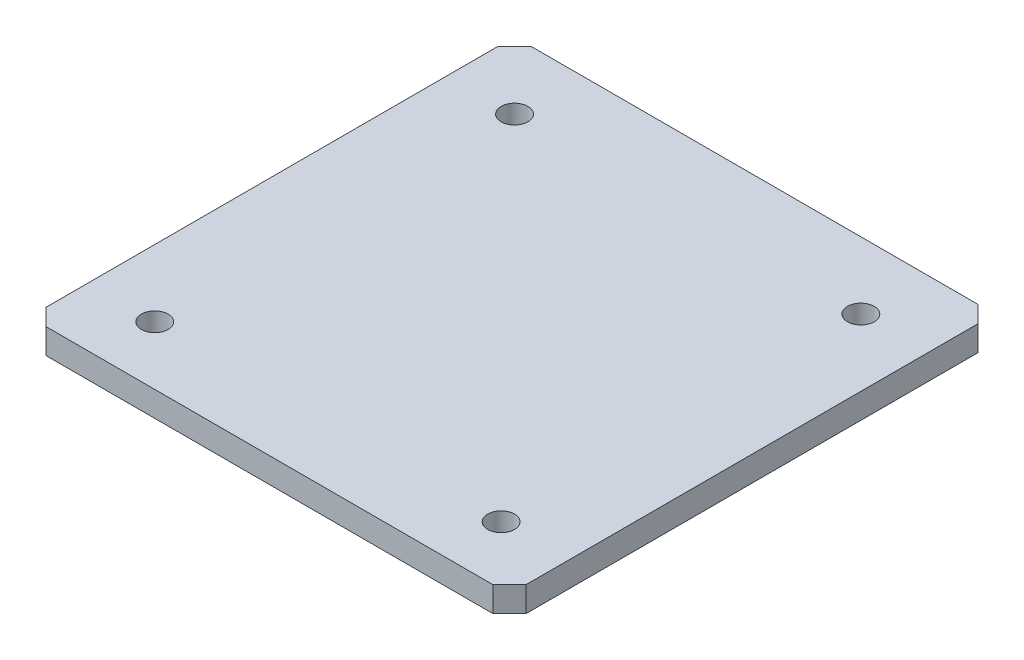
ISO-10303-21;
HEADER;
FILE_DESCRIPTION(('STEP AP214'),'2;1');
FILE_NAME('part.step','',(''),(''),'','','');
FILE_SCHEMA(('AUTOMOTIVE_DESIGN { 1 0 10303 214 1 1 1 1 }'));
ENDSEC;
DATA;
#1=APPLICATION_CONTEXT('core data for automotive mechanical design processes');
#2=APPLICATION_PROTOCOL_DEFINITION('international standard','automotive_design',2000,#1);
#3=PRODUCT_CONTEXT('',#1,'mechanical');
#4=PRODUCT('Part','Part','',(#3));
#5=PRODUCT_RELATED_PRODUCT_CATEGORY('part','',(#4));
#6=PRODUCT_DEFINITION_FORMATION('','',#4);
#7=PRODUCT_DEFINITION_CONTEXT('part definition',#1,'design');
#8=PRODUCT_DEFINITION('design','',#6,#7);
#9=PRODUCT_DEFINITION_SHAPE('','',#8);
#10=(LENGTH_UNIT() NAMED_UNIT(*) SI_UNIT(.MILLI.,.METRE.));
#11=(NAMED_UNIT(*) PLANE_ANGLE_UNIT() SI_UNIT($,.RADIAN.));
#12=(NAMED_UNIT(*) SI_UNIT($,.STERADIAN.) SOLID_ANGLE_UNIT());
#13=UNCERTAINTY_MEASURE_WITH_UNIT(LENGTH_MEASURE(1.E-05),#10,'distance_accuracy_value','');
#14=(GEOMETRIC_REPRESENTATION_CONTEXT(3) GLOBAL_UNCERTAINTY_ASSIGNED_CONTEXT((#13)) GLOBAL_UNIT_ASSIGNED_CONTEXT((#10,
#11,#12)) REPRESENTATION_CONTEXT('',''));
#15=CARTESIAN_POINT('',(0.,0.,0.));
#16=DIRECTION('',(0.,0.,1.));
#17=DIRECTION('',(1.,0.,0.));
#18=AXIS2_PLACEMENT_3D('',#15,#16,#17);
#19=CARTESIAN_POINT('',(0.,7.5,0.));
#20=DIRECTION('',(1.,0.,0.));
#21=DIRECTION('',(0.,0.,-1.));
#22=AXIS2_PLACEMENT_3D('',#19,#20,#21);
#23=PLANE('',#22);
#24=DIRECTION('',(0.,0.,1.));
#25=VECTOR('',#24,1.);
#26=CARTESIAN_POINT('',(0.,7.5,0.));
#27=LINE('',#26,#25);
#28=CARTESIAN_POINT('',(0.,7.5,-280.));
#29=VERTEX_POINT('',#28);
#30=CARTESIAN_POINT('',(0.,7.5,-10.0000000000001));
#31=VERTEX_POINT('',#30);
#32=EDGE_CURVE('E128',#29,#31,#27,.T.);
#33=ORIENTED_EDGE('',*,*,#32,.F.);
#34=DIRECTION('',(0.,-1.,0.));
#35=VECTOR('',#34,1.);
#36=CARTESIAN_POINT('',(0.,7.5,-280.));
#37=LINE('',#36,#35);
#38=CARTESIAN_POINT('',(0.,-7.5,-280.));
#39=VERTEX_POINT('',#38);
#40=EDGE_CURVE('E113',#29,#39,#37,.T.);
#41=ORIENTED_EDGE('',*,*,#40,.T.);
#42=DIRECTION('',(0.,0.,1.));
#43=VECTOR('',#42,1.);
#44=CARTESIAN_POINT('',(0.,-7.5,0.));
#45=LINE('',#44,#43);
#46=CARTESIAN_POINT('',(0.,-7.5,-10.0000000000001));
#47=VERTEX_POINT('',#46);
#48=EDGE_CURVE('E125',#39,#47,#45,.T.);
#49=ORIENTED_EDGE('',*,*,#48,.T.);
#50=DIRECTION('',(0.,1.,0.));
#51=VECTOR('',#50,1.);
#52=CARTESIAN_POINT('',(0.,7.5,-10.0000000000001));
#53=LINE('',#52,#51);
#54=EDGE_CURVE('E130',#47,#31,#53,.T.);
#55=ORIENTED_EDGE('',*,*,#54,.T.);
#56=EDGE_LOOP('',(#33,#41,#49,#55));
#57=FACE_BOUND('',#56,.T.);
#58=ADVANCED_FACE('F39',(#57),#23,.F.);
#59=CARTESIAN_POINT('',(0.,7.5,0.));
#60=DIRECTION('',(0.,0.,-1.));
#61=DIRECTION('',(-1.,0.,0.));
#62=AXIS2_PLACEMENT_3D('',#59,#60,#61);
#63=PLANE('',#62);
#64=DIRECTION('',(1.,0.,0.));
#65=VECTOR('',#64,1.);
#66=CARTESIAN_POINT('',(0.,7.5,0.));
#67=LINE('',#66,#65);
#68=CARTESIAN_POINT('',(10.,7.5,0.));
#69=VERTEX_POINT('',#68);
#70=CARTESIAN_POINT('',(277.,7.5,0.));
#71=VERTEX_POINT('',#70);
#72=EDGE_CURVE('E207',#69,#71,#67,.T.);
#73=ORIENTED_EDGE('',*,*,#72,.F.);
#74=DIRECTION('',(0.,-1.,0.));
#75=VECTOR('',#74,1.);
#76=CARTESIAN_POINT('',(10.,7.5,0.));
#77=LINE('',#76,#75);
#78=CARTESIAN_POINT('',(10.,-7.5,0.));
#79=VERTEX_POINT('',#78);
#80=EDGE_CURVE('E11',#69,#79,#77,.T.);
#81=ORIENTED_EDGE('',*,*,#80,.T.);
#82=DIRECTION('',(1.,0.,0.));
#83=VECTOR('',#82,1.);
#84=CARTESIAN_POINT('',(0.,-7.5,0.));
#85=LINE('',#84,#83);
#86=CARTESIAN_POINT('',(277.,-7.5,0.));
#87=VERTEX_POINT('',#86);
#88=EDGE_CURVE('E135',#79,#87,#85,.T.);
#89=ORIENTED_EDGE('',*,*,#88,.T.);
#90=DIRECTION('',(0.,1.,0.));
#91=VECTOR('',#90,1.);
#92=CARTESIAN_POINT('',(277.,7.5,0.));
#93=LINE('',#92,#91);
#94=EDGE_CURVE('E49',#87,#71,#93,.T.);
#95=ORIENTED_EDGE('',*,*,#94,.T.);
#96=EDGE_LOOP('',(#73,#81,#89,#95));
#97=FACE_BOUND('',#96,.T.);
#98=ADVANCED_FACE('F224',(#97),#63,.F.);
#99=CARTESIAN_POINT('',(287.,7.5,0.));
#100=DIRECTION('',(-1.,0.,0.));
#101=DIRECTION('',(0.,0.,1.));
#102=AXIS2_PLACEMENT_3D('',#99,#100,#101);
#103=PLANE('',#102);
#104=DIRECTION('',(0.,0.,-1.));
#105=VECTOR('',#104,1.);
#106=CARTESIAN_POINT('',(287.,-7.5,0.));
#107=LINE('',#106,#105);
#108=CARTESIAN_POINT('',(287.,-7.5,-10.));
#109=VERTEX_POINT('',#108);
#110=CARTESIAN_POINT('',(287.,-7.5,-280.));
#111=VERTEX_POINT('',#110);
#112=EDGE_CURVE('E138',#109,#111,#107,.T.);
#113=ORIENTED_EDGE('',*,*,#112,.T.);
#114=DIRECTION('',(0.,1.,0.));
#115=VECTOR('',#114,1.);
#116=CARTESIAN_POINT('',(287.,7.5,-280.));
#117=LINE('',#116,#115);
#118=CARTESIAN_POINT('',(287.,7.5,-280.));
#119=VERTEX_POINT('',#118);
#120=EDGE_CURVE('E57',#111,#119,#117,.T.);
#121=ORIENTED_EDGE('',*,*,#120,.T.);
#122=DIRECTION('',(0.,0.,-1.));
#123=VECTOR('',#122,1.);
#124=CARTESIAN_POINT('',(287.,7.5,0.));
#125=LINE('',#124,#123);
#126=CARTESIAN_POINT('',(287.,7.5,-10.));
#127=VERTEX_POINT('',#126);
#128=EDGE_CURVE('E208',#127,#119,#125,.T.);
#129=ORIENTED_EDGE('',*,*,#128,.F.);
#130=DIRECTION('',(0.,-1.,0.));
#131=VECTOR('',#130,1.);
#132=CARTESIAN_POINT('',(287.,7.5,-10.));
#133=LINE('',#132,#131);
#134=EDGE_CURVE('E163',#127,#109,#133,.T.);
#135=ORIENTED_EDGE('',*,*,#134,.T.);
#136=EDGE_LOOP('',(#113,#121,#129,#135));
#137=FACE_BOUND('',#136,.T.);
#138=ADVANCED_FACE('F218',(#137),#103,.F.);
#139=CARTESIAN_POINT('',(0.,7.5,-290.));
#140=DIRECTION('',(0.,0.,1.));
#141=DIRECTION('',(1.,0.,0.));
#142=AXIS2_PLACEMENT_3D('',#139,#140,#141);
#143=PLANE('',#142);
#144=DIRECTION('',(-1.,0.,0.));
#145=VECTOR('',#144,1.);
#146=CARTESIAN_POINT('',(0.,-7.5,-290.));
#147=LINE('',#146,#145);
#148=CARTESIAN_POINT('',(277.,-7.5,-290.));
#149=VERTEX_POINT('',#148);
#150=CARTESIAN_POINT('',(10.0000000000001,-7.5,-290.));
#151=VERTEX_POINT('',#150);
#152=EDGE_CURVE('E147',#149,#151,#147,.T.);
#153=ORIENTED_EDGE('',*,*,#152,.T.);
#154=DIRECTION('',(0.,1.,0.));
#155=VECTOR('',#154,1.);
#156=CARTESIAN_POINT('',(10.0000000000001,7.5,-290.));
#157=LINE('',#156,#155);
#158=CARTESIAN_POINT('',(10.0000000000001,7.5,-290.));
#159=VERTEX_POINT('',#158);
#160=EDGE_CURVE('E114',#151,#159,#157,.T.);
#161=ORIENTED_EDGE('',*,*,#160,.T.);
#162=DIRECTION('',(-1.,0.,0.));
#163=VECTOR('',#162,1.);
#164=CARTESIAN_POINT('',(0.,7.5,-290.));
#165=LINE('',#164,#163);
#166=CARTESIAN_POINT('',(277.,7.5,-290.));
#167=VERTEX_POINT('',#166);
#168=EDGE_CURVE('E143',#167,#159,#165,.T.);
#169=ORIENTED_EDGE('',*,*,#168,.F.);
#170=DIRECTION('',(0.,-1.,0.));
#171=VECTOR('',#170,1.);
#172=CARTESIAN_POINT('',(277.,7.5,-290.));
#173=LINE('',#172,#171);
#174=EDGE_CURVE('E119',#167,#149,#173,.T.);
#175=ORIENTED_EDGE('',*,*,#174,.T.);
#176=EDGE_LOOP('',(#153,#161,#169,#175));
#177=FACE_BOUND('',#176,.T.);
#178=ADVANCED_FACE('F214',(#177),#143,.F.);
#179=CARTESIAN_POINT('',(0.,7.5,0.));
#180=DIRECTION('',(0.,-1.,0.));
#181=DIRECTION('',(0.,0.,-1.));
#182=AXIS2_PLACEMENT_3D('',#179,#180,#181);
#183=PLANE('',#182);
#184=CARTESIAN_POINT('',(246.999999999996,7.5,-35.0000000000001));
#185=DIRECTION('',(0.,1.,0.));
#186=DIRECTION('',(0.,0.,1.));
#187=AXIS2_PLACEMENT_3D('',#184,#185,#186);
#188=CIRCLE('',#187,8.00000000000001);
#189=CARTESIAN_POINT('',(246.999999999996,7.5,-27.0000000000001));
#190=VERTEX_POINT('',#189);
#191=EDGE_CURVE('E204',#190,#190,#188,.T.);
#192=ORIENTED_EDGE('',*,*,#191,.F.);
#193=EDGE_LOOP('',(#192));
#194=FACE_BOUND('',#193,.T.);
#195=CARTESIAN_POINT('',(246.999999999996,7.5,-250.));
#196=DIRECTION('',(0.,1.,0.));
#197=DIRECTION('',(0.,0.,1.));
#198=AXIS2_PLACEMENT_3D('',#195,#196,#197);
#199=CIRCLE('',#198,8.00000000000001);
#200=CARTESIAN_POINT('',(246.999999999996,7.5,-242.));
#201=VERTEX_POINT('',#200);
#202=EDGE_CURVE('E200',#201,#201,#199,.T.);
#203=ORIENTED_EDGE('',*,*,#202,.F.);
#204=EDGE_LOOP('',(#203));
#205=FACE_BOUND('',#204,.T.);
#206=CARTESIAN_POINT('',(39.9999999999957,7.5,-250.));
#207=DIRECTION('',(0.,1.,0.));
#208=DIRECTION('',(0.,0.,1.));
#209=AXIS2_PLACEMENT_3D('',#206,#207,#208);
#210=CIRCLE('',#209,8.00000000000001);
#211=CARTESIAN_POINT('',(39.9999999999957,7.5,-242.));
#212=VERTEX_POINT('',#211);
#213=EDGE_CURVE('E197',#212,#212,#210,.T.);
#214=ORIENTED_EDGE('',*,*,#213,.F.);
#215=EDGE_LOOP('',(#214));
#216=FACE_BOUND('',#215,.T.);
#217=CARTESIAN_POINT('',(39.9999999999956,7.5,-35.0000000000001));
#218=DIRECTION('',(0.,1.,0.));
#219=DIRECTION('',(0.,0.,1.));
#220=AXIS2_PLACEMENT_3D('',#217,#218,#219);
#221=CIRCLE('',#220,8.00000000000001);
#222=CARTESIAN_POINT('',(39.9999999999956,7.5,-27.0000000000001));
#223=VERTEX_POINT('',#222);
#224=EDGE_CURVE('E172',#223,#223,#221,.T.);
#225=ORIENTED_EDGE('',*,*,#224,.F.);
#226=EDGE_LOOP('',(#225));
#227=FACE_BOUND('',#226,.T.);
#228=ORIENTED_EDGE('',*,*,#168,.T.);
#229=DIRECTION('',(0.707106781186549,0.,-0.707106781186546));
#230=VECTOR('',#229,1.);
#231=CARTESIAN_POINT('',(0.,7.5,-280.));
#232=LINE('',#231,#230);
#233=EDGE_CURVE('E161',#159,#29,#232,.F.);
#234=ORIENTED_EDGE('',*,*,#233,.T.);
#235=ORIENTED_EDGE('',*,*,#32,.T.);
#236=DIRECTION('',(-0.707106781186546,0.,-0.707106781186549));
#237=VECTOR('',#236,1.);
#238=CARTESIAN_POINT('',(10.,7.5,0.));
#239=LINE('',#238,#237);
#240=EDGE_CURVE('E157',#31,#69,#239,.F.);
#241=ORIENTED_EDGE('',*,*,#240,.T.);
#242=ORIENTED_EDGE('',*,*,#72,.T.);
#243=DIRECTION('',(-0.707106781186549,0.,0.707106781186546));
#244=VECTOR('',#243,1.);
#245=CARTESIAN_POINT('',(287.,7.5,-10.));
#246=LINE('',#245,#244);
#247=EDGE_CURVE('E64',#71,#127,#246,.F.);
#248=ORIENTED_EDGE('',*,*,#247,.T.);
#249=ORIENTED_EDGE('',*,*,#128,.T.);
#250=DIRECTION('',(0.707106781186546,0.,0.707106781186549));
#251=VECTOR('',#250,1.);
#252=CARTESIAN_POINT('',(277.,7.5,-290.));
#253=LINE('',#252,#251);
#254=EDGE_CURVE('E159',#119,#167,#253,.F.);
#255=ORIENTED_EDGE('',*,*,#254,.T.);
#256=EDGE_LOOP('',(#228,#234,#235,#241,#242,#248,#249,#255));
#257=FACE_BOUND('',#256,.T.);
#258=ADVANCED_FACE('F182',(#194,#205,#216,#227,#257),#183,.F.);
#259=CARTESIAN_POINT('',(0.,-7.5,0.));
#260=DIRECTION('',(0.,-1.,0.));
#261=DIRECTION('',(0.,0.,-1.));
#262=AXIS2_PLACEMENT_3D('',#259,#260,#261);
#263=PLANE('',#262);
#264=CARTESIAN_POINT('',(246.999999999996,-7.5,-35.0000000000001));
#265=DIRECTION('',(0.,-1.,0.));
#266=DIRECTION('',(0.,0.,-1.));
#267=AXIS2_PLACEMENT_3D('',#264,#265,#266);
#268=CIRCLE('',#267,8.00000000000001);
#269=CARTESIAN_POINT('',(246.999999999996,-7.5,-43.0000000000001));
#270=VERTEX_POINT('',#269);
#271=EDGE_CURVE('E44',#270,#270,#268,.T.);
#272=ORIENTED_EDGE('',*,*,#271,.F.);
#273=EDGE_LOOP('',(#272));
#274=FACE_BOUND('',#273,.T.);
#275=CARTESIAN_POINT('',(246.999999999996,-7.5,-250.));
#276=DIRECTION('',(0.,-1.,0.));
#277=DIRECTION('',(0.,0.,-1.));
#278=AXIS2_PLACEMENT_3D('',#275,#276,#277);
#279=CIRCLE('',#278,8.00000000000001);
#280=CARTESIAN_POINT('',(246.999999999996,-7.5,-258.));
#281=VERTEX_POINT('',#280);
#282=EDGE_CURVE('E141',#281,#281,#279,.T.);
#283=ORIENTED_EDGE('',*,*,#282,.F.);
#284=EDGE_LOOP('',(#283));
#285=FACE_BOUND('',#284,.T.);
#286=CARTESIAN_POINT('',(39.9999999999957,-7.5,-250.));
#287=DIRECTION('',(0.,-1.,0.));
#288=DIRECTION('',(0.,0.,-1.));
#289=AXIS2_PLACEMENT_3D('',#286,#287,#288);
#290=CIRCLE('',#289,8.00000000000001);
#291=CARTESIAN_POINT('',(39.9999999999957,-7.5,-258.));
#292=VERTEX_POINT('',#291);
#293=EDGE_CURVE('E171',#292,#292,#290,.T.);
#294=ORIENTED_EDGE('',*,*,#293,.F.);
#295=EDGE_LOOP('',(#294));
#296=FACE_BOUND('',#295,.T.);
#297=CARTESIAN_POINT('',(39.9999999999956,-7.5,-35.0000000000001));
#298=DIRECTION('',(0.,-1.,0.));
#299=DIRECTION('',(0.,0.,-1.));
#300=AXIS2_PLACEMENT_3D('',#297,#298,#299);
#301=CIRCLE('',#300,8.00000000000001);
#302=CARTESIAN_POINT('',(39.9999999999956,-7.5,-43.0000000000001));
#303=VERTEX_POINT('',#302);
#304=EDGE_CURVE('E168',#303,#303,#301,.T.);
#305=ORIENTED_EDGE('',*,*,#304,.F.);
#306=EDGE_LOOP('',(#305));
#307=FACE_BOUND('',#306,.T.);
#308=ORIENTED_EDGE('',*,*,#48,.F.);
#309=DIRECTION('',(-0.707106781186549,0.,0.707106781186546));
#310=VECTOR('',#309,1.);
#311=CARTESIAN_POINT('',(-140.,-7.5,-140.000000000001));
#312=LINE('',#311,#310);
#313=EDGE_CURVE('E109',#39,#151,#312,.F.);
#314=ORIENTED_EDGE('',*,*,#313,.T.);
#315=ORIENTED_EDGE('',*,*,#152,.F.);
#316=DIRECTION('',(-0.707106781186546,0.,-0.707106781186549));
#317=VECTOR('',#316,1.);
#318=CARTESIAN_POINT('',(283.500000000001,-7.5,-283.499999999999));
#319=LINE('',#318,#317);
#320=EDGE_CURVE('E120',#149,#111,#319,.F.);
#321=ORIENTED_EDGE('',*,*,#320,.T.);
#322=ORIENTED_EDGE('',*,*,#112,.F.);
#323=DIRECTION('',(0.707106781186549,0.,-0.707106781186546));
#324=VECTOR('',#323,1.);
#325=CARTESIAN_POINT('',(138.499999999999,-7.5,138.5));
#326=LINE('',#325,#324);
#327=EDGE_CURVE('E129',#109,#87,#326,.F.);
#328=ORIENTED_EDGE('',*,*,#327,.T.);
#329=ORIENTED_EDGE('',*,*,#88,.F.);
#330=DIRECTION('',(0.707106781186546,0.,0.707106781186549));
#331=VECTOR('',#330,1.);
#332=CARTESIAN_POINT('',(5.00000000000003,-7.5,-5.));
#333=LINE('',#332,#331);
#334=EDGE_CURVE('E134',#79,#47,#333,.F.);
#335=ORIENTED_EDGE('',*,*,#334,.T.);
#336=EDGE_LOOP('',(#308,#314,#315,#321,#322,#328,#329,#335));
#337=FACE_BOUND('',#336,.T.);
#338=ADVANCED_FACE('F132',(#274,#285,#296,#307,#337),#263,.T.);
#339=CARTESIAN_POINT('',(0.,7.5,-280.));
#340=DIRECTION('',(0.707106781186545,0.,0.707106781186549));
#341=DIRECTION('',(0.,-1.,0.));
#342=AXIS2_PLACEMENT_3D('',#339,#340,#341);
#343=PLANE('',#342);
#344=ORIENTED_EDGE('',*,*,#233,.F.);
#345=ORIENTED_EDGE('',*,*,#160,.F.);
#346=ORIENTED_EDGE('',*,*,#313,.F.);
#347=ORIENTED_EDGE('',*,*,#40,.F.);
#348=EDGE_LOOP('',(#344,#345,#346,#347));
#349=FACE_BOUND('',#348,.T.);
#350=ADVANCED_FACE('F112',(#349),#343,.F.);
#351=CARTESIAN_POINT('',(277.,7.5,-290.));
#352=DIRECTION('',(-0.707106781186549,0.,0.707106781186545));
#353=DIRECTION('',(0.,-1.,0.));
#354=AXIS2_PLACEMENT_3D('',#351,#352,#353);
#355=PLANE('',#354);
#356=ORIENTED_EDGE('',*,*,#254,.F.);
#357=ORIENTED_EDGE('',*,*,#120,.F.);
#358=ORIENTED_EDGE('',*,*,#320,.F.);
#359=ORIENTED_EDGE('',*,*,#174,.F.);
#360=EDGE_LOOP('',(#356,#357,#358,#359));
#361=FACE_BOUND('',#360,.T.);
#362=ADVANCED_FACE('F216',(#361),#355,.F.);
#363=CARTESIAN_POINT('',(10.,7.5,0.));
#364=DIRECTION('',(0.707106781186549,0.,-0.707106781186545));
#365=DIRECTION('',(0.,-1.,0.));
#366=AXIS2_PLACEMENT_3D('',#363,#364,#365);
#367=PLANE('',#366);
#368=ORIENTED_EDGE('',*,*,#240,.F.);
#369=ORIENTED_EDGE('',*,*,#54,.F.);
#370=ORIENTED_EDGE('',*,*,#334,.F.);
#371=ORIENTED_EDGE('',*,*,#80,.F.);
#372=EDGE_LOOP('',(#368,#369,#370,#371));
#373=FACE_BOUND('',#372,.T.);
#374=ADVANCED_FACE('F228',(#373),#367,.F.);
#375=CARTESIAN_POINT('',(287.,7.5,-10.));
#376=DIRECTION('',(-0.707106781186545,0.,-0.707106781186549));
#377=DIRECTION('',(0.,-1.,0.));
#378=AXIS2_PLACEMENT_3D('',#375,#376,#377);
#379=PLANE('',#378);
#380=ORIENTED_EDGE('',*,*,#247,.F.);
#381=ORIENTED_EDGE('',*,*,#94,.F.);
#382=ORIENTED_EDGE('',*,*,#327,.F.);
#383=ORIENTED_EDGE('',*,*,#134,.F.);
#384=EDGE_LOOP('',(#380,#381,#382,#383));
#385=FACE_BOUND('',#384,.T.);
#386=ADVANCED_FACE('F42',(#385),#379,.F.);
#387=CARTESIAN_POINT('',(39.9999999999956,-8.5,-35.0000000000001));
#388=DIRECTION('',(0.,1.,0.));
#389=DIRECTION('',(0.,0.,1.));
#390=AXIS2_PLACEMENT_3D('',#387,#388,#389);
#391=CYLINDRICAL_SURFACE('',#390,8.00000000000001);
#392=ORIENTED_EDGE('',*,*,#304,.T.);
#393=EDGE_LOOP('',(#392));
#394=FACE_BOUND('',#393,.T.);
#395=ORIENTED_EDGE('',*,*,#224,.T.);
#396=EDGE_LOOP('',(#395));
#397=FACE_BOUND('',#396,.T.);
#398=ADVANCED_FACE('F189',(#394,#397),#391,.F.);
#399=CARTESIAN_POINT('',(39.9999999999957,-8.5,-250.));
#400=DIRECTION('',(0.,1.,0.));
#401=DIRECTION('',(0.,0.,1.));
#402=AXIS2_PLACEMENT_3D('',#399,#400,#401);
#403=CYLINDRICAL_SURFACE('',#402,8.00000000000001);
#404=ORIENTED_EDGE('',*,*,#293,.T.);
#405=EDGE_LOOP('',(#404));
#406=FACE_BOUND('',#405,.T.);
#407=ORIENTED_EDGE('',*,*,#213,.T.);
#408=EDGE_LOOP('',(#407));
#409=FACE_BOUND('',#408,.T.);
#410=ADVANCED_FACE('F192',(#406,#409),#403,.F.);
#411=CARTESIAN_POINT('',(246.999999999996,-8.5,-250.));
#412=DIRECTION('',(0.,1.,0.));
#413=DIRECTION('',(0.,0.,1.));
#414=AXIS2_PLACEMENT_3D('',#411,#412,#413);
#415=CYLINDRICAL_SURFACE('',#414,8.00000000000001);
#416=ORIENTED_EDGE('',*,*,#282,.T.);
#417=EDGE_LOOP('',(#416));
#418=FACE_BOUND('',#417,.T.);
#419=ORIENTED_EDGE('',*,*,#202,.T.);
#420=EDGE_LOOP('',(#419));
#421=FACE_BOUND('',#420,.T.);
#422=ADVANCED_FACE('F177',(#418,#421),#415,.F.);
#423=CARTESIAN_POINT('',(246.999999999996,-8.5,-35.0000000000001));
#424=DIRECTION('',(0.,1.,0.));
#425=DIRECTION('',(0.,0.,1.));
#426=AXIS2_PLACEMENT_3D('',#423,#424,#425);
#427=CYLINDRICAL_SURFACE('',#426,8.00000000000001);
#428=ORIENTED_EDGE('',*,*,#271,.T.);
#429=EDGE_LOOP('',(#428));
#430=FACE_BOUND('',#429,.T.);
#431=ORIENTED_EDGE('',*,*,#191,.T.);
#432=EDGE_LOOP('',(#431));
#433=FACE_BOUND('',#432,.T.);
#434=ADVANCED_FACE('F313',(#430,#433),#427,.F.);
#435=CLOSED_SHELL('',(#58,#98,#138,#178,#258,#338,#350,#362,#374,#386,#398,#410,#422,#434));
#436=MANIFOLD_SOLID_BREP('B2',#435);
#437=ADVANCED_BREP_SHAPE_REPRESENTATION('',(#18,#436),#14);
#438=SHAPE_DEFINITION_REPRESENTATION(#9,#437);
ENDSEC;
END-ISO-10303-21;
